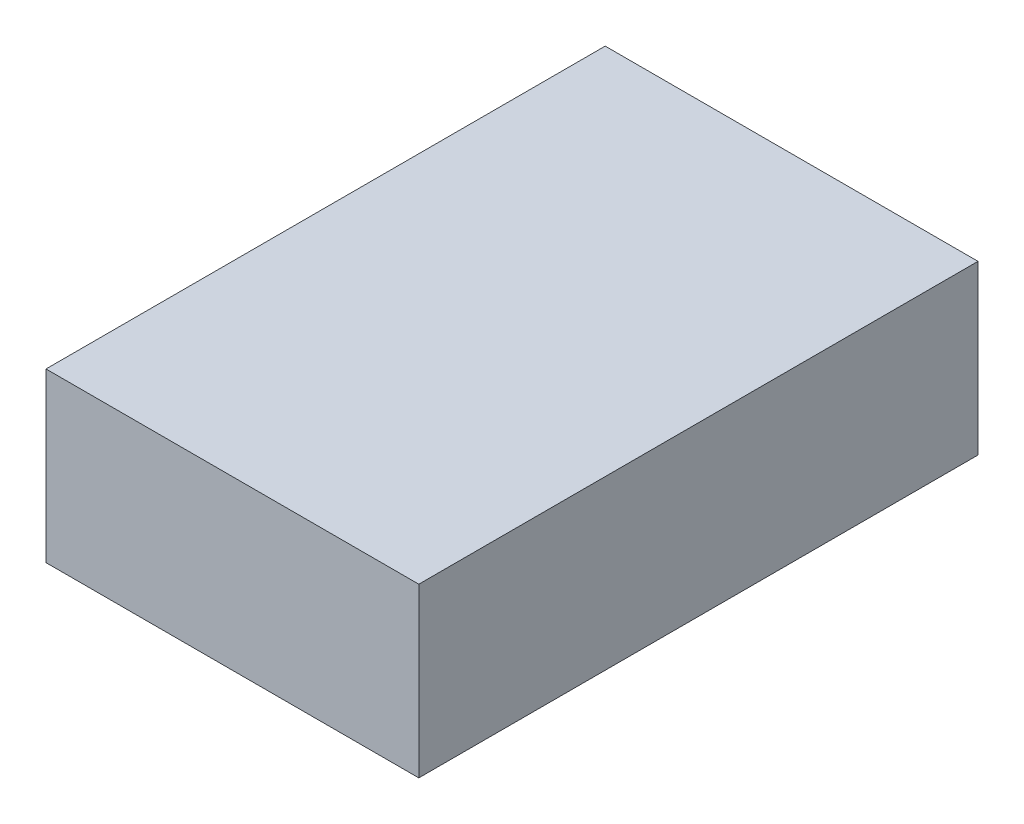
ISO-10303-21;
HEADER;
FILE_DESCRIPTION(('STEP AP214'),'2;1');
FILE_NAME('part.step','',(''),(''),'','','');
FILE_SCHEMA(('AUTOMOTIVE_DESIGN { 1 0 10303 214 1 1 1 1 }'));
ENDSEC;
DATA;
#1=APPLICATION_CONTEXT('core data for automotive mechanical design processes');
#2=APPLICATION_PROTOCOL_DEFINITION('international standard','automotive_design',2000,#1);
#3=PRODUCT_CONTEXT('',#1,'mechanical');
#4=PRODUCT('Part','Part','',(#3));
#5=PRODUCT_RELATED_PRODUCT_CATEGORY('part','',(#4));
#6=PRODUCT_DEFINITION_FORMATION('','',#4);
#7=PRODUCT_DEFINITION_CONTEXT('part definition',#1,'design');
#8=PRODUCT_DEFINITION('design','',#6,#7);
#9=PRODUCT_DEFINITION_SHAPE('','',#8);
#10=(LENGTH_UNIT() NAMED_UNIT(*) SI_UNIT(.MILLI.,.METRE.));
#11=(NAMED_UNIT(*) PLANE_ANGLE_UNIT() SI_UNIT($,.RADIAN.));
#12=(NAMED_UNIT(*) SI_UNIT($,.STERADIAN.) SOLID_ANGLE_UNIT());
#13=UNCERTAINTY_MEASURE_WITH_UNIT(LENGTH_MEASURE(1.E-05),#10,'distance_accuracy_value','');
#14=(GEOMETRIC_REPRESENTATION_CONTEXT(3) GLOBAL_UNCERTAINTY_ASSIGNED_CONTEXT((#13)) GLOBAL_UNIT_ASSIGNED_CONTEXT((#10,
#11,#12)) REPRESENTATION_CONTEXT('',''));
#15=CARTESIAN_POINT('',(0.,0.,0.));
#16=DIRECTION('',(0.,0.,1.));
#17=DIRECTION('',(1.,0.,0.));
#18=AXIS2_PLACEMENT_3D('',#15,#16,#17);
#19=CARTESIAN_POINT('',(0.999999999999999,0.9,-1.5));
#20=DIRECTION('',(-1.,0.,0.));
#21=DIRECTION('',(0.,0.,1.));
#22=AXIS2_PLACEMENT_3D('',#19,#20,#21);
#23=PLANE('',#22);
#24=DIRECTION('',(0.,0.,-1.));
#25=VECTOR('',#24,1.);
#26=CARTESIAN_POINT('',(0.999999999999999,0.,-1.5));
#27=LINE('',#26,#25);
#28=CARTESIAN_POINT('',(1.,0.,1.5));
#29=VERTEX_POINT('',#28);
#30=CARTESIAN_POINT('',(0.999999999999999,0.,-1.5));
#31=VERTEX_POINT('',#30);
#32=EDGE_CURVE('E107',#29,#31,#27,.T.);
#33=ORIENTED_EDGE('',*,*,#32,.T.);
#34=DIRECTION('',(0.,-1.,0.));
#35=VECTOR('',#34,1.);
#36=CARTESIAN_POINT('',(0.999999999999999,0.9,-1.5));
#37=LINE('',#36,#35);
#38=CARTESIAN_POINT('',(0.999999999999999,0.9,-1.5));
#39=VERTEX_POINT('',#38);
#40=EDGE_CURVE('E11',#39,#31,#37,.T.);
#41=ORIENTED_EDGE('',*,*,#40,.F.);
#42=DIRECTION('',(0.,0.,-1.));
#43=VECTOR('',#42,1.);
#44=CARTESIAN_POINT('',(0.999999999999999,0.9,-1.5));
#45=LINE('',#44,#43);
#46=CARTESIAN_POINT('',(1.,0.9,1.5));
#47=VERTEX_POINT('',#46);
#48=EDGE_CURVE('E91',#47,#39,#45,.T.);
#49=ORIENTED_EDGE('',*,*,#48,.F.);
#50=DIRECTION('',(0.,-1.,0.));
#51=VECTOR('',#50,1.);
#52=CARTESIAN_POINT('',(1.,0.9,1.5));
#53=LINE('',#52,#51);
#54=EDGE_CURVE('E103',#47,#29,#53,.T.);
#55=ORIENTED_EDGE('',*,*,#54,.T.);
#56=EDGE_LOOP('',(#33,#41,#49,#55));
#57=FACE_BOUND('',#56,.T.);
#58=ADVANCED_FACE('F39',(#57),#23,.F.);
#59=CARTESIAN_POINT('',(-1.,0.9,-1.5));
#60=DIRECTION('',(0.,0.,1.));
#61=DIRECTION('',(1.,0.,0.));
#62=AXIS2_PLACEMENT_3D('',#59,#60,#61);
#63=PLANE('',#62);
#64=DIRECTION('',(-1.,0.,0.));
#65=VECTOR('',#64,1.);
#66=CARTESIAN_POINT('',(-1.,0.,-1.5));
#67=LINE('',#66,#65);
#68=CARTESIAN_POINT('',(-1.,0.,-1.5));
#69=VERTEX_POINT('',#68);
#70=EDGE_CURVE('E96',#31,#69,#67,.T.);
#71=ORIENTED_EDGE('',*,*,#70,.T.);
#72=DIRECTION('',(0.,-1.,0.));
#73=VECTOR('',#72,1.);
#74=CARTESIAN_POINT('',(-1.,0.9,-1.5));
#75=LINE('',#74,#73);
#76=CARTESIAN_POINT('',(-1.,0.9,-1.5));
#77=VERTEX_POINT('',#76);
#78=EDGE_CURVE('E48',#77,#69,#75,.T.);
#79=ORIENTED_EDGE('',*,*,#78,.F.);
#80=DIRECTION('',(-1.,0.,0.));
#81=VECTOR('',#80,1.);
#82=CARTESIAN_POINT('',(-1.,0.9,-1.5));
#83=LINE('',#82,#81);
#84=EDGE_CURVE('E86',#39,#77,#83,.T.);
#85=ORIENTED_EDGE('',*,*,#84,.F.);
#86=ORIENTED_EDGE('',*,*,#40,.T.);
#87=EDGE_LOOP('',(#71,#79,#85,#86));
#88=FACE_BOUND('',#87,.T.);
#89=ADVANCED_FACE('F95',(#88),#63,.F.);
#90=CARTESIAN_POINT('',(-1.,0.9,-1.5));
#91=DIRECTION('',(1.,0.,0.));
#92=DIRECTION('',(0.,0.,-1.));
#93=AXIS2_PLACEMENT_3D('',#90,#91,#92);
#94=PLANE('',#93);
#95=DIRECTION('',(0.,0.,1.));
#96=VECTOR('',#95,1.);
#97=CARTESIAN_POINT('',(-1.,0.,-1.5));
#98=LINE('',#97,#96);
#99=CARTESIAN_POINT('',(-1.,0.,1.5));
#100=VERTEX_POINT('',#99);
#101=EDGE_CURVE('E73',#69,#100,#98,.T.);
#102=ORIENTED_EDGE('',*,*,#101,.T.);
#103=DIRECTION('',(0.,-1.,0.));
#104=VECTOR('',#103,1.);
#105=CARTESIAN_POINT('',(-1.,0.9,1.5));
#106=LINE('',#105,#104);
#107=CARTESIAN_POINT('',(-1.,0.9,1.5));
#108=VERTEX_POINT('',#107);
#109=EDGE_CURVE('E98',#108,#100,#106,.T.);
#110=ORIENTED_EDGE('',*,*,#109,.F.);
#111=DIRECTION('',(0.,0.,1.));
#112=VECTOR('',#111,1.);
#113=CARTESIAN_POINT('',(-1.,0.9,-1.5));
#114=LINE('',#113,#112);
#115=EDGE_CURVE('E89',#77,#108,#114,.T.);
#116=ORIENTED_EDGE('',*,*,#115,.F.);
#117=ORIENTED_EDGE('',*,*,#78,.T.);
#118=EDGE_LOOP('',(#102,#110,#116,#117));
#119=FACE_BOUND('',#118,.T.);
#120=ADVANCED_FACE('F99',(#119),#94,.F.);
#121=CARTESIAN_POINT('',(-1.,0.9,1.5));
#122=DIRECTION('',(0.,0.,-1.));
#123=DIRECTION('',(-1.,0.,0.));
#124=AXIS2_PLACEMENT_3D('',#121,#122,#123);
#125=PLANE('',#124);
#126=DIRECTION('',(1.,0.,0.));
#127=VECTOR('',#126,1.);
#128=CARTESIAN_POINT('',(-1.,0.,1.5));
#129=LINE('',#128,#127);
#130=EDGE_CURVE('E79',#100,#29,#129,.T.);
#131=ORIENTED_EDGE('',*,*,#130,.T.);
#132=ORIENTED_EDGE('',*,*,#54,.F.);
#133=DIRECTION('',(1.,0.,0.));
#134=VECTOR('',#133,1.);
#135=CARTESIAN_POINT('',(-1.,0.9,1.5));
#136=LINE('',#135,#134);
#137=EDGE_CURVE('E56',#108,#47,#136,.T.);
#138=ORIENTED_EDGE('',*,*,#137,.F.);
#139=ORIENTED_EDGE('',*,*,#109,.T.);
#140=EDGE_LOOP('',(#131,#132,#138,#139));
#141=FACE_BOUND('',#140,.T.);
#142=ADVANCED_FACE('F120',(#141),#125,.F.);
#143=CARTESIAN_POINT('',(0.,0.9,0.));
#144=DIRECTION('',(0.,1.,0.));
#145=DIRECTION('',(0.,0.,1.));
#146=AXIS2_PLACEMENT_3D('',#143,#144,#145);
#147=PLANE('',#146);
#148=ORIENTED_EDGE('',*,*,#48,.T.);
#149=ORIENTED_EDGE('',*,*,#84,.T.);
#150=ORIENTED_EDGE('',*,*,#115,.T.);
#151=ORIENTED_EDGE('',*,*,#137,.T.);
#152=EDGE_LOOP('',(#148,#149,#150,#151));
#153=FACE_BOUND('',#152,.T.);
#154=ADVANCED_FACE('F87',(#153),#147,.T.);
#155=CARTESIAN_POINT('',(0.,0.,0.));
#156=DIRECTION('',(0.,1.,0.));
#157=DIRECTION('',(0.,0.,1.));
#158=AXIS2_PLACEMENT_3D('',#155,#156,#157);
#159=PLANE('',#158);
#160=ORIENTED_EDGE('',*,*,#32,.F.);
#161=ORIENTED_EDGE('',*,*,#130,.F.);
#162=ORIENTED_EDGE('',*,*,#101,.F.);
#163=ORIENTED_EDGE('',*,*,#70,.F.);
#164=EDGE_LOOP('',(#160,#161,#162,#163));
#165=FACE_BOUND('',#164,.T.);
#166=ADVANCED_FACE('F123',(#165),#159,.F.);
#167=CLOSED_SHELL('',(#58,#89,#120,#142,#154,#166));
#168=MANIFOLD_SOLID_BREP('B2',#167);
#169=ADVANCED_BREP_SHAPE_REPRESENTATION('',(#18,#168),#14);
#170=SHAPE_DEFINITION_REPRESENTATION(#9,#169);
ENDSEC;
END-ISO-10303-21;
